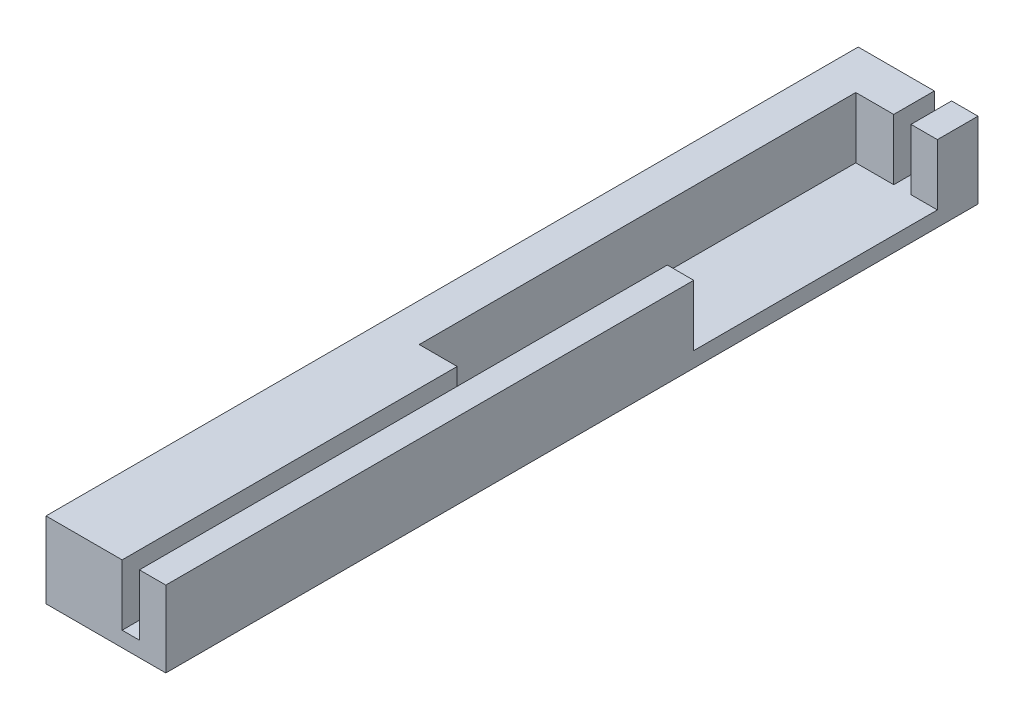
ISO-10303-21;
HEADER;
FILE_DESCRIPTION(('STEP AP214'),'2;1');
FILE_NAME('part.step','',(''),(''),'','','');
FILE_SCHEMA(('AUTOMOTIVE_DESIGN { 1 0 10303 214 1 1 1 1 }'));
ENDSEC;
DATA;
#1=APPLICATION_CONTEXT('core data for automotive mechanical design processes');
#2=APPLICATION_PROTOCOL_DEFINITION('international standard','automotive_design',2000,#1);
#3=PRODUCT_CONTEXT('',#1,'mechanical');
#4=PRODUCT('Part','Part','',(#3));
#5=PRODUCT_RELATED_PRODUCT_CATEGORY('part','',(#4));
#6=PRODUCT_DEFINITION_FORMATION('','',#4);
#7=PRODUCT_DEFINITION_CONTEXT('part definition',#1,'design');
#8=PRODUCT_DEFINITION('design','',#6,#7);
#9=PRODUCT_DEFINITION_SHAPE('','',#8);
#10=(LENGTH_UNIT() NAMED_UNIT(*) SI_UNIT(.MILLI.,.METRE.));
#11=(NAMED_UNIT(*) PLANE_ANGLE_UNIT() SI_UNIT($,.RADIAN.));
#12=(NAMED_UNIT(*) SI_UNIT($,.STERADIAN.) SOLID_ANGLE_UNIT());
#13=UNCERTAINTY_MEASURE_WITH_UNIT(LENGTH_MEASURE(1.E-05),#10,'distance_accuracy_value','');
#14=(GEOMETRIC_REPRESENTATION_CONTEXT(3) GLOBAL_UNCERTAINTY_ASSIGNED_CONTEXT((#13)) GLOBAL_UNIT_ASSIGNED_CONTEXT((#10,
#11,#12)) REPRESENTATION_CONTEXT('',''));
#15=CARTESIAN_POINT('',(0.,0.,0.));
#16=DIRECTION('',(0.,0.,1.));
#17=DIRECTION('',(1.,0.,0.));
#18=AXIS2_PLACEMENT_3D('',#15,#16,#17);
#19=CARTESIAN_POINT('',(3.73803486529319,7.5,-1.98621236133122));
#20=DIRECTION('',(-1.,0.,0.));
#21=DIRECTION('',(0.,0.,1.));
#22=AXIS2_PLACEMENT_3D('',#19,#20,#21);
#23=PLANE('',#22);
#24=DIRECTION('',(0.,0.,-1.));
#25=VECTOR('',#24,1.);
#26=CARTESIAN_POINT('',(3.73803486529319,1.5,-1.98621236133122));
#27=LINE('',#26,#25);
#28=CARTESIAN_POINT('',(3.73803486529319,1.5,78.0137876386688));
#29=VERTEX_POINT('',#28);
#30=CARTESIAN_POINT('',(3.73803486529321,1.5,45.0137876386688));
#31=VERTEX_POINT('',#30);
#32=EDGE_CURVE('E257',#29,#31,#27,.T.);
#33=ORIENTED_EDGE('',*,*,#32,.T.);
#34=DIRECTION('',(0.,1.,0.));
#35=VECTOR('',#34,1.);
#36=CARTESIAN_POINT('',(3.73803486529321,-41.662169832553,45.0137876386688));
#37=LINE('',#36,#35);
#38=CARTESIAN_POINT('',(3.73803486529321,7.5,45.0137876386688));
#39=VERTEX_POINT('',#38);
#40=EDGE_CURVE('E181',#31,#39,#37,.T.);
#41=ORIENTED_EDGE('',*,*,#40,.T.);
#42=DIRECTION('',(0.,0.,-1.));
#43=VECTOR('',#42,1.);
#44=CARTESIAN_POINT('',(3.73803486529319,7.5,-1.98621236133122));
#45=LINE('',#44,#43);
#46=CARTESIAN_POINT('',(3.73803486529319,7.5,78.0137876386688));
#47=VERTEX_POINT('',#46);
#48=EDGE_CURVE('E261',#47,#39,#45,.T.);
#49=ORIENTED_EDGE('',*,*,#48,.F.);
#50=DIRECTION('',(0.,-1.,0.));
#51=VECTOR('',#50,1.);
#52=CARTESIAN_POINT('',(3.73803486529319,7.5,78.0137876386688));
#53=LINE('',#52,#51);
#54=EDGE_CURVE('E275',#47,#29,#53,.T.);
#55=ORIENTED_EDGE('',*,*,#54,.T.);
#56=EDGE_LOOP('',(#33,#41,#49,#55));
#57=FACE_BOUND('',#56,.T.);
#58=ADVANCED_FACE('F38',(#57),#23,.F.);
#59=CARTESIAN_POINT('',(5.43803486529318,7.5,-1.98621236133122));
#60=DIRECTION('',(1.,0.,0.));
#61=DIRECTION('',(0.,0.,-1.));
#62=AXIS2_PLACEMENT_3D('',#59,#60,#61);
#63=PLANE('',#62);
#64=DIRECTION('',(0.,0.,1.));
#65=VECTOR('',#64,1.);
#66=CARTESIAN_POINT('',(5.43803486529318,1.5,-1.98621236133122));
#67=LINE('',#66,#65);
#68=CARTESIAN_POINT('',(5.43803486529318,1.5,-1.98621236133122));
#69=VERTEX_POINT('',#68);
#70=CARTESIAN_POINT('',(5.43803486529318,1.5,2.01378763866878));
#71=VERTEX_POINT('',#70);
#72=EDGE_CURVE('E240',#69,#71,#67,.T.);
#73=ORIENTED_EDGE('',*,*,#72,.T.);
#74=DIRECTION('',(0.,1.,0.));
#75=VECTOR('',#74,1.);
#76=CARTESIAN_POINT('',(5.43803486529318,-41.662169832553,2.01378763866878));
#77=LINE('',#76,#75);
#78=CARTESIAN_POINT('',(5.43803486529318,7.5,2.01378763866878));
#79=VERTEX_POINT('',#78);
#80=EDGE_CURVE('E199',#71,#79,#77,.T.);
#81=ORIENTED_EDGE('',*,*,#80,.T.);
#82=DIRECTION('',(0.,0.,1.));
#83=VECTOR('',#82,1.);
#84=CARTESIAN_POINT('',(5.43803486529318,7.5,-1.98621236133122));
#85=LINE('',#84,#83);
#86=CARTESIAN_POINT('',(5.43803486529318,7.5,-1.98621236133122));
#87=VERTEX_POINT('',#86);
#88=EDGE_CURVE('E222',#87,#79,#85,.T.);
#89=ORIENTED_EDGE('',*,*,#88,.F.);
#90=DIRECTION('',(0.,-1.,0.));
#91=VECTOR('',#90,1.);
#92=CARTESIAN_POINT('',(5.43803486529318,7.5,-1.98621236133122));
#93=LINE('',#92,#91);
#94=EDGE_CURVE('E239',#87,#69,#93,.T.);
#95=ORIENTED_EDGE('',*,*,#94,.T.);
#96=EDGE_LOOP('',(#73,#81,#89,#95));
#97=FACE_BOUND('',#96,.T.);
#98=ADVANCED_FACE('F342',(#97),#63,.F.);
#99=CARTESIAN_POINT('',(0.,7.5,0.));
#100=DIRECTION('',(0.,1.,0.));
#101=DIRECTION('',(0.,0.,1.));
#102=AXIS2_PLACEMENT_3D('',#99,#100,#101);
#103=PLANE('',#102);
#104=DIRECTION('',(-1.,0.,0.));
#105=VECTOR('',#104,1.);
#106=CARTESIAN_POINT('',(5.43803486529318,7.5,2.01378763866878));
#107=LINE('',#106,#105);
#108=CARTESIAN_POINT('',(8.0380348652932,7.5,2.01378763866878));
#109=VERTEX_POINT('',#108);
#110=EDGE_CURVE('E205',#109,#79,#107,.T.);
#111=ORIENTED_EDGE('',*,*,#110,.F.);
#112=DIRECTION('',(0.,0.,-1.));
#113=VECTOR('',#112,1.);
#114=CARTESIAN_POINT('',(8.0380348652932,7.5,-1.98621236133122));
#115=LINE('',#114,#113);
#116=CARTESIAN_POINT('',(8.0380348652932,7.5,-1.98621236133122));
#117=VERTEX_POINT('',#116);
#118=EDGE_CURVE('E231',#109,#117,#115,.T.);
#119=ORIENTED_EDGE('',*,*,#118,.T.);
#120=DIRECTION('',(-1.,0.,0.));
#121=VECTOR('',#120,1.);
#122=CARTESIAN_POINT('',(5.43803486529318,7.5,-1.98621236133122));
#123=LINE('',#122,#121);
#124=EDGE_CURVE('E236',#117,#87,#123,.T.);
#125=ORIENTED_EDGE('',*,*,#124,.T.);
#126=ORIENTED_EDGE('',*,*,#88,.T.);
#127=EDGE_LOOP('',(#111,#119,#125,#126));
#128=FACE_BOUND('',#127,.T.);
#129=ADVANCED_FACE('F345',(#128),#103,.T.);
#130=CARTESIAN_POINT('',(0.,1.5,0.));
#131=DIRECTION('',(0.,1.,0.));
#132=DIRECTION('',(0.,0.,1.));
#133=AXIS2_PLACEMENT_3D('',#130,#131,#132);
#134=PLANE('',#133);
#135=DIRECTION('',(1.,0.,0.));
#136=VECTOR('',#135,1.);
#137=CARTESIAN_POINT('',(-3.76196513470681,1.5,78.0137876386688));
#138=LINE('',#137,#136);
#139=CARTESIAN_POINT('',(5.43803486529319,1.5,78.0137876386688));
#140=VERTEX_POINT('',#139);
#141=EDGE_CURVE('E280',#29,#140,#138,.T.);
#142=ORIENTED_EDGE('',*,*,#141,.T.);
#143=CARTESIAN_POINT('',(5.43803486529319,1.5,26.0137876386688));
#144=VERTEX_POINT('',#143);
#145=EDGE_CURVE('E192',#144,#140,#67,.T.);
#146=ORIENTED_EDGE('',*,*,#145,.F.);
#147=DIRECTION('',(-1.,0.,0.));
#148=VECTOR('',#147,1.);
#149=CARTESIAN_POINT('',(5.43803486529319,1.5,26.0137876386688));
#150=LINE('',#149,#148);
#151=CARTESIAN_POINT('',(8.0380348652932,1.49999999999999,26.0137876386688));
#152=VERTEX_POINT('',#151);
#153=EDGE_CURVE('E170',#152,#144,#150,.T.);
#154=ORIENTED_EDGE('',*,*,#153,.F.);
#155=DIRECTION('',(0.,0.,1.));
#156=VECTOR('',#155,1.);
#157=CARTESIAN_POINT('',(8.0380348652932,1.5,2.01378763866878));
#158=LINE('',#157,#156);
#159=CARTESIAN_POINT('',(8.0380348652932,1.5,2.01378763866878));
#160=VERTEX_POINT('',#159);
#161=EDGE_CURVE('E194',#160,#152,#158,.T.);
#162=ORIENTED_EDGE('',*,*,#161,.F.);
#163=DIRECTION('',(1.,0.,0.));
#164=VECTOR('',#163,1.);
#165=CARTESIAN_POINT('',(5.43803486529318,1.5,2.01378763866878));
#166=LINE('',#165,#164);
#167=EDGE_CURVE('E198',#71,#160,#166,.T.);
#168=ORIENTED_EDGE('',*,*,#167,.F.);
#169=ORIENTED_EDGE('',*,*,#72,.F.);
#170=DIRECTION('',(-1.,0.,0.));
#171=VECTOR('',#170,1.);
#172=CARTESIAN_POINT('',(-3.76196513470681,1.5,-1.98621236133122));
#173=LINE('',#172,#171);
#174=CARTESIAN_POINT('',(3.73803486529319,1.5,-1.98621236133122));
#175=VERTEX_POINT('',#174);
#176=EDGE_CURVE('E284',#69,#175,#173,.T.);
#177=ORIENTED_EDGE('',*,*,#176,.T.);
#178=CARTESIAN_POINT('',(3.73803486529319,1.5,2.01378763866877));
#179=VERTEX_POINT('',#178);
#180=EDGE_CURVE('E251',#179,#175,#27,.T.);
#181=ORIENTED_EDGE('',*,*,#180,.F.);
#182=DIRECTION('',(1.,0.,0.));
#183=VECTOR('',#182,1.);
#184=CARTESIAN_POINT('',(3.73803486529319,1.5,2.01378763866877));
#185=LINE('',#184,#183);
#186=CARTESIAN_POINT('',(0.,1.49999999999999,2.01378763866878));
#187=VERTEX_POINT('',#186);
#188=EDGE_CURVE('E189',#187,#179,#185,.T.);
#189=ORIENTED_EDGE('',*,*,#188,.F.);
#190=DIRECTION('',(0.,0.,-1.));
#191=VECTOR('',#190,1.);
#192=CARTESIAN_POINT('',(0.,1.5,2.01378763866878));
#193=LINE('',#192,#191);
#194=CARTESIAN_POINT('',(0.,1.5,45.0137876386688));
#195=VERTEX_POINT('',#194);
#196=EDGE_CURVE('E160',#195,#187,#193,.T.);
#197=ORIENTED_EDGE('',*,*,#196,.F.);
#198=DIRECTION('',(-1.,0.,0.));
#199=VECTOR('',#198,1.);
#200=CARTESIAN_POINT('',(3.73803486529321,1.5,45.0137876386688));
#201=LINE('',#200,#199);
#202=EDGE_CURVE('E193',#31,#195,#201,.T.);
#203=ORIENTED_EDGE('',*,*,#202,.F.);
#204=ORIENTED_EDGE('',*,*,#32,.F.);
#205=EDGE_LOOP('',(#142,#146,#154,#162,#168,#169,#177,#181,#189,#197,#203,#204));
#206=FACE_BOUND('',#205,.T.);
#207=ADVANCED_FACE('F337',(#206),#134,.T.);
#208=CARTESIAN_POINT('',(-3.76196513470681,1.5,-1.98621236133122));
#209=DIRECTION('',(1.,0.,0.));
#210=DIRECTION('',(0.,0.,-1.));
#211=AXIS2_PLACEMENT_3D('',#208,#209,#210);
#212=PLANE('',#211);
#213=DIRECTION('',(0.,0.,1.));
#214=VECTOR('',#213,1.);
#215=CARTESIAN_POINT('',(-3.76196513470681,0.,-1.98621236133122));
#216=LINE('',#215,#214);
#217=CARTESIAN_POINT('',(-3.76196513470681,0.,-1.98621236133122));
#218=VERTEX_POINT('',#217);
#219=CARTESIAN_POINT('',(-3.76196513470681,0.,78.0137876386688));
#220=VERTEX_POINT('',#219);
#221=EDGE_CURVE('E279',#218,#220,#216,.T.);
#222=ORIENTED_EDGE('',*,*,#221,.T.);
#223=DIRECTION('',(0.,-1.,0.));
#224=VECTOR('',#223,1.);
#225=CARTESIAN_POINT('',(-3.76196513470681,1.5,78.0137876386688));
#226=LINE('',#225,#224);
#227=CARTESIAN_POINT('',(-3.76196513470681,7.5,78.0137876386688));
#228=VERTEX_POINT('',#227);
#229=EDGE_CURVE('E11',#228,#220,#226,.T.);
#230=ORIENTED_EDGE('',*,*,#229,.F.);
#231=DIRECTION('',(0.,0.,1.));
#232=VECTOR('',#231,1.);
#233=CARTESIAN_POINT('',(-3.76196513470681,7.5,-1.98621236133122));
#234=LINE('',#233,#232);
#235=CARTESIAN_POINT('',(-3.76196513470681,7.5,-1.98621236133122));
#236=VERTEX_POINT('',#235);
#237=EDGE_CURVE('E252',#236,#228,#234,.T.);
#238=ORIENTED_EDGE('',*,*,#237,.F.);
#239=DIRECTION('',(0.,-1.,0.));
#240=VECTOR('',#239,1.);
#241=CARTESIAN_POINT('',(-3.76196513470681,1.5,-1.98621236133122));
#242=LINE('',#241,#240);
#243=EDGE_CURVE('E289',#236,#218,#242,.T.);
#244=ORIENTED_EDGE('',*,*,#243,.T.);
#245=EDGE_LOOP('',(#222,#230,#238,#244));
#246=FACE_BOUND('',#245,.T.);
#247=ADVANCED_FACE('F40',(#246),#212,.F.);
#248=CARTESIAN_POINT('',(-3.76196513470681,1.5,78.0137876386688));
#249=DIRECTION('',(0.,0.,-1.));
#250=DIRECTION('',(-1.,0.,0.));
#251=AXIS2_PLACEMENT_3D('',#248,#249,#250);
#252=PLANE('',#251);
#253=DIRECTION('',(1.,0.,0.));
#254=VECTOR('',#253,1.);
#255=CARTESIAN_POINT('',(-3.76196513470681,0.,78.0137876386688));
#256=LINE('',#255,#254);
#257=CARTESIAN_POINT('',(8.0380348652932,0.,78.0137876386688));
#258=VERTEX_POINT('',#257);
#259=EDGE_CURVE('E293',#220,#258,#256,.T.);
#260=ORIENTED_EDGE('',*,*,#259,.T.);
#261=DIRECTION('',(0.,-1.,0.));
#262=VECTOR('',#261,1.);
#263=CARTESIAN_POINT('',(8.0380348652932,1.5,78.0137876386688));
#264=LINE('',#263,#262);
#265=CARTESIAN_POINT('',(8.0380348652932,7.5,78.0137876386688));
#266=VERTEX_POINT('',#265);
#267=EDGE_CURVE('E47',#266,#258,#264,.T.);
#268=ORIENTED_EDGE('',*,*,#267,.F.);
#269=DIRECTION('',(1.,0.,0.));
#270=VECTOR('',#269,1.);
#271=CARTESIAN_POINT('',(5.43803486529319,7.5,78.0137876386688));
#272=LINE('',#271,#270);
#273=CARTESIAN_POINT('',(5.43803486529319,7.5,78.0137876386688));
#274=VERTEX_POINT('',#273);
#275=EDGE_CURVE('E226',#274,#266,#272,.T.);
#276=ORIENTED_EDGE('',*,*,#275,.F.);
#277=DIRECTION('',(0.,-1.,0.));
#278=VECTOR('',#277,1.);
#279=CARTESIAN_POINT('',(5.43803486529319,7.5,78.0137876386688));
#280=LINE('',#279,#278);
#281=EDGE_CURVE('E247',#274,#140,#280,.T.);
#282=ORIENTED_EDGE('',*,*,#281,.T.);
#283=ORIENTED_EDGE('',*,*,#141,.F.);
#284=ORIENTED_EDGE('',*,*,#54,.F.);
#285=DIRECTION('',(1.,0.,0.));
#286=VECTOR('',#285,1.);
#287=CARTESIAN_POINT('',(-3.76196513470681,7.5,78.0137876386688));
#288=LINE('',#287,#286);
#289=EDGE_CURVE('E256',#228,#47,#288,.T.);
#290=ORIENTED_EDGE('',*,*,#289,.F.);
#291=ORIENTED_EDGE('',*,*,#229,.T.);
#292=EDGE_LOOP('',(#260,#268,#276,#282,#283,#284,#290,#291));
#293=FACE_BOUND('',#292,.T.);
#294=ADVANCED_FACE('F359',(#293),#252,.F.);
#295=CARTESIAN_POINT('',(8.03803486529319,1.5,-1.98621236133122));
#296=DIRECTION('',(-1.,0.,0.));
#297=DIRECTION('',(0.,0.,1.));
#298=AXIS2_PLACEMENT_3D('',#295,#296,#297);
#299=PLANE('',#298);
#300=ORIENTED_EDGE('',*,*,#118,.F.);
#301=DIRECTION('',(0.,1.,0.));
#302=VECTOR('',#301,1.);
#303=CARTESIAN_POINT('',(8.0380348652932,-41.662169832553,2.01378763866878));
#304=LINE('',#303,#302);
#305=EDGE_CURVE('E211',#160,#109,#304,.T.);
#306=ORIENTED_EDGE('',*,*,#305,.F.);
#307=ORIENTED_EDGE('',*,*,#161,.T.);
#308=DIRECTION('',(0.,1.,0.));
#309=VECTOR('',#308,1.);
#310=CARTESIAN_POINT('',(8.0380348652932,-41.662169832553,26.0137876386688));
#311=LINE('',#310,#309);
#312=CARTESIAN_POINT('',(8.0380348652932,7.5,26.0137876386688));
#313=VERTEX_POINT('',#312);
#314=EDGE_CURVE('E214',#152,#313,#311,.T.);
#315=ORIENTED_EDGE('',*,*,#314,.T.);
#316=EDGE_CURVE('E232',#266,#313,#115,.T.);
#317=ORIENTED_EDGE('',*,*,#316,.F.);
#318=ORIENTED_EDGE('',*,*,#267,.T.);
#319=DIRECTION('',(0.,0.,-1.));
#320=VECTOR('',#319,1.);
#321=CARTESIAN_POINT('',(8.03803486529319,0.,-1.98621236133122));
#322=LINE('',#321,#320);
#323=CARTESIAN_POINT('',(8.03803486529319,0.,-1.98621236133122));
#324=VERTEX_POINT('',#323);
#325=EDGE_CURVE('E296',#258,#324,#322,.T.);
#326=ORIENTED_EDGE('',*,*,#325,.T.);
#327=DIRECTION('',(0.,-1.,0.));
#328=VECTOR('',#327,1.);
#329=CARTESIAN_POINT('',(8.03803486529319,1.5,-1.98621236133122));
#330=LINE('',#329,#328);
#331=EDGE_CURVE('E304',#117,#324,#330,.T.);
#332=ORIENTED_EDGE('',*,*,#331,.F.);
#333=EDGE_LOOP('',(#300,#306,#307,#315,#317,#318,#326,#332));
#334=FACE_BOUND('',#333,.T.);
#335=ADVANCED_FACE('F313',(#334),#299,.F.);
#336=CARTESIAN_POINT('',(-3.76196513470681,1.5,-1.98621236133122));
#337=DIRECTION('',(0.,0.,1.));
#338=DIRECTION('',(1.,0.,0.));
#339=AXIS2_PLACEMENT_3D('',#336,#337,#338);
#340=PLANE('',#339);
#341=DIRECTION('',(-1.,0.,0.));
#342=VECTOR('',#341,1.);
#343=CARTESIAN_POINT('',(-3.76196513470681,0.,-1.98621236133122));
#344=LINE('',#343,#342);
#345=EDGE_CURVE('E285',#324,#218,#344,.T.);
#346=ORIENTED_EDGE('',*,*,#345,.T.);
#347=ORIENTED_EDGE('',*,*,#243,.F.);
#348=DIRECTION('',(-1.,0.,0.));
#349=VECTOR('',#348,1.);
#350=CARTESIAN_POINT('',(-3.76196513470681,7.5,-1.98621236133122));
#351=LINE('',#350,#349);
#352=CARTESIAN_POINT('',(3.73803486529319,7.5,-1.98621236133122));
#353=VERTEX_POINT('',#352);
#354=EDGE_CURVE('E264',#353,#236,#351,.T.);
#355=ORIENTED_EDGE('',*,*,#354,.F.);
#356=DIRECTION('',(0.,-1.,0.));
#357=VECTOR('',#356,1.);
#358=CARTESIAN_POINT('',(3.73803486529319,7.5,-1.98621236133122));
#359=LINE('',#358,#357);
#360=EDGE_CURVE('E268',#353,#175,#359,.T.);
#361=ORIENTED_EDGE('',*,*,#360,.T.);
#362=ORIENTED_EDGE('',*,*,#176,.F.);
#363=ORIENTED_EDGE('',*,*,#94,.F.);
#364=ORIENTED_EDGE('',*,*,#124,.F.);
#365=ORIENTED_EDGE('',*,*,#331,.T.);
#366=EDGE_LOOP('',(#346,#347,#355,#361,#362,#363,#364,#365));
#367=FACE_BOUND('',#366,.T.);
#368=ADVANCED_FACE('F322',(#367),#340,.F.);
#369=CARTESIAN_POINT('',(0.,0.,0.));
#370=DIRECTION('',(0.,1.,0.));
#371=DIRECTION('',(0.,0.,1.));
#372=AXIS2_PLACEMENT_3D('',#369,#370,#371);
#373=PLANE('',#372);
#374=ORIENTED_EDGE('',*,*,#221,.F.);
#375=ORIENTED_EDGE('',*,*,#345,.F.);
#376=ORIENTED_EDGE('',*,*,#325,.F.);
#377=ORIENTED_EDGE('',*,*,#259,.F.);
#378=EDGE_LOOP('',(#374,#375,#376,#377));
#379=FACE_BOUND('',#378,.T.);
#380=ADVANCED_FACE('F320',(#379),#373,.F.);
#381=CARTESIAN_POINT('',(3.73803486529319,7.5,2.01378763866878));
#382=VERTEX_POINT('',#381);
#383=EDGE_CURVE('E260',#382,#353,#45,.T.);
#384=ORIENTED_EDGE('',*,*,#383,.F.);
#385=DIRECTION('',(0.,1.,0.));
#386=VECTOR('',#385,1.);
#387=CARTESIAN_POINT('',(3.73803486529319,-41.662169832553,2.01378763866877));
#388=LINE('',#387,#386);
#389=EDGE_CURVE('E54',#179,#382,#388,.T.);
#390=ORIENTED_EDGE('',*,*,#389,.F.);
#391=ORIENTED_EDGE('',*,*,#180,.T.);
#392=ORIENTED_EDGE('',*,*,#360,.F.);
#393=EDGE_LOOP('',(#384,#390,#391,#392));
#394=FACE_BOUND('',#393,.T.);
#395=ADVANCED_FACE('F333',(#394),#23,.F.);
#396=CARTESIAN_POINT('',(0.,7.5,0.));
#397=DIRECTION('',(0.,1.,0.));
#398=DIRECTION('',(0.,0.,1.));
#399=AXIS2_PLACEMENT_3D('',#396,#397,#398);
#400=PLANE('',#399);
#401=DIRECTION('',(1.,0.,0.));
#402=VECTOR('',#401,1.);
#403=CARTESIAN_POINT('',(3.73803486529321,7.5,45.0137876386688));
#404=LINE('',#403,#402);
#405=CARTESIAN_POINT('',(0.,7.5,45.0137876386688));
#406=VERTEX_POINT('',#405);
#407=EDGE_CURVE('E174',#406,#39,#404,.T.);
#408=ORIENTED_EDGE('',*,*,#407,.F.);
#409=DIRECTION('',(0.,0.,1.));
#410=VECTOR('',#409,1.);
#411=CARTESIAN_POINT('',(0.,7.5,2.01378763866878));
#412=LINE('',#411,#410);
#413=CARTESIAN_POINT('',(0.,7.5,2.01378763866878));
#414=VERTEX_POINT('',#413);
#415=EDGE_CURVE('E157',#414,#406,#412,.T.);
#416=ORIENTED_EDGE('',*,*,#415,.F.);
#417=DIRECTION('',(-1.,0.,0.));
#418=VECTOR('',#417,1.);
#419=CARTESIAN_POINT('',(3.73803486529319,7.5,2.01378763866877));
#420=LINE('',#419,#418);
#421=EDGE_CURVE('E165',#382,#414,#420,.T.);
#422=ORIENTED_EDGE('',*,*,#421,.F.);
#423=ORIENTED_EDGE('',*,*,#383,.T.);
#424=ORIENTED_EDGE('',*,*,#354,.T.);
#425=ORIENTED_EDGE('',*,*,#237,.T.);
#426=ORIENTED_EDGE('',*,*,#289,.T.);
#427=ORIENTED_EDGE('',*,*,#48,.T.);
#428=EDGE_LOOP('',(#408,#416,#422,#423,#424,#425,#426,#427));
#429=FACE_BOUND('',#428,.T.);
#430=ADVANCED_FACE('F172',(#429),#400,.T.);
#431=CARTESIAN_POINT('',(5.43803486529319,7.5,26.0137876386688));
#432=VERTEX_POINT('',#431);
#433=EDGE_CURVE('E227',#432,#274,#85,.T.);
#434=ORIENTED_EDGE('',*,*,#433,.F.);
#435=DIRECTION('',(0.,1.,0.));
#436=VECTOR('',#435,1.);
#437=CARTESIAN_POINT('',(5.43803486529319,-41.662169832553,26.0137876386688));
#438=LINE('',#437,#436);
#439=EDGE_CURVE('E62',#144,#432,#438,.T.);
#440=ORIENTED_EDGE('',*,*,#439,.F.);
#441=ORIENTED_EDGE('',*,*,#145,.T.);
#442=ORIENTED_EDGE('',*,*,#281,.F.);
#443=EDGE_LOOP('',(#434,#440,#441,#442));
#444=FACE_BOUND('',#443,.T.);
#445=ADVANCED_FACE('F369',(#444),#63,.F.);
#446=DIRECTION('',(1.,0.,0.));
#447=VECTOR('',#446,1.);
#448=CARTESIAN_POINT('',(5.43803486529319,7.5,26.0137876386688));
#449=LINE('',#448,#447);
#450=EDGE_CURVE('E202',#432,#313,#449,.T.);
#451=ORIENTED_EDGE('',*,*,#450,.F.);
#452=ORIENTED_EDGE('',*,*,#433,.T.);
#453=ORIENTED_EDGE('',*,*,#275,.T.);
#454=ORIENTED_EDGE('',*,*,#316,.T.);
#455=EDGE_LOOP('',(#451,#452,#453,#454));
#456=FACE_BOUND('',#455,.T.);
#457=ADVANCED_FACE('F398',(#456),#103,.T.);
#458=CARTESIAN_POINT('',(5.43803486529318,-41.662169832553,2.01378763866878));
#459=DIRECTION('',(0.,0.,-1.));
#460=DIRECTION('',(-1.,0.,0.));
#461=AXIS2_PLACEMENT_3D('',#458,#459,#460);
#462=PLANE('',#461);
#463=ORIENTED_EDGE('',*,*,#167,.T.);
#464=ORIENTED_EDGE('',*,*,#305,.T.);
#465=ORIENTED_EDGE('',*,*,#110,.T.);
#466=ORIENTED_EDGE('',*,*,#80,.F.);
#467=EDGE_LOOP('',(#463,#464,#465,#466));
#468=FACE_BOUND('',#467,.T.);
#469=ADVANCED_FACE('F403',(#468),#462,.F.);
#470=CARTESIAN_POINT('',(5.43803486529319,-41.662169832553,26.0137876386688));
#471=DIRECTION('',(0.,0.,1.));
#472=DIRECTION('',(1.,0.,0.));
#473=AXIS2_PLACEMENT_3D('',#470,#471,#472);
#474=PLANE('',#473);
#475=ORIENTED_EDGE('',*,*,#153,.T.);
#476=ORIENTED_EDGE('',*,*,#439,.T.);
#477=ORIENTED_EDGE('',*,*,#450,.T.);
#478=ORIENTED_EDGE('',*,*,#314,.F.);
#479=EDGE_LOOP('',(#475,#476,#477,#478));
#480=FACE_BOUND('',#479,.T.);
#481=ADVANCED_FACE('F409',(#480),#474,.F.);
#482=CARTESIAN_POINT('',(3.73803486529321,-41.662169832553,45.0137876386688));
#483=DIRECTION('',(0.,0.,1.));
#484=DIRECTION('',(1.,0.,0.));
#485=AXIS2_PLACEMENT_3D('',#482,#483,#484);
#486=PLANE('',#485);
#487=ORIENTED_EDGE('',*,*,#202,.T.);
#488=DIRECTION('',(0.,1.,0.));
#489=VECTOR('',#488,1.);
#490=CARTESIAN_POINT('',(0.,-41.662169832553,45.0137876386688));
#491=LINE('',#490,#489);
#492=EDGE_CURVE('E163',#195,#406,#491,.T.);
#493=ORIENTED_EDGE('',*,*,#492,.T.);
#494=ORIENTED_EDGE('',*,*,#407,.T.);
#495=ORIENTED_EDGE('',*,*,#40,.F.);
#496=EDGE_LOOP('',(#487,#493,#494,#495));
#497=FACE_BOUND('',#496,.T.);
#498=ADVANCED_FACE('F355',(#497),#486,.F.);
#499=CARTESIAN_POINT('',(0.,-41.662169832553,2.01378763866878));
#500=DIRECTION('',(-1.,0.,0.));
#501=DIRECTION('',(0.,0.,1.));
#502=AXIS2_PLACEMENT_3D('',#499,#500,#501);
#503=PLANE('',#502);
#504=ORIENTED_EDGE('',*,*,#196,.T.);
#505=DIRECTION('',(0.,1.,0.));
#506=VECTOR('',#505,1.);
#507=CARTESIAN_POINT('',(0.,-41.662169832553,2.01378763866878));
#508=LINE('',#507,#506);
#509=EDGE_CURVE('E153',#187,#414,#508,.T.);
#510=ORIENTED_EDGE('',*,*,#509,.T.);
#511=ORIENTED_EDGE('',*,*,#415,.T.);
#512=ORIENTED_EDGE('',*,*,#492,.F.);
#513=EDGE_LOOP('',(#504,#510,#511,#512));
#514=FACE_BOUND('',#513,.T.);
#515=ADVANCED_FACE('F154',(#514),#503,.F.);
#516=CARTESIAN_POINT('',(3.73803486529319,-41.662169832553,2.01378763866877));
#517=DIRECTION('',(0.,0.,-1.));
#518=DIRECTION('',(-1.,0.,0.));
#519=AXIS2_PLACEMENT_3D('',#516,#517,#518);
#520=PLANE('',#519);
#521=ORIENTED_EDGE('',*,*,#188,.T.);
#522=ORIENTED_EDGE('',*,*,#389,.T.);
#523=ORIENTED_EDGE('',*,*,#421,.T.);
#524=ORIENTED_EDGE('',*,*,#509,.F.);
#525=EDGE_LOOP('',(#521,#522,#523,#524));
#526=FACE_BOUND('',#525,.T.);
#527=ADVANCED_FACE('F166',(#526),#520,.F.);
#528=CLOSED_SHELL('',(#58,#98,#129,#207,#247,#294,#335,#368,#380,#395,#430,#445,#457,#469,#481,
#498,#515,#527));
#529=MANIFOLD_SOLID_BREP('B2',#528);
#530=ADVANCED_BREP_SHAPE_REPRESENTATION('',(#18,#529),#14);
#531=SHAPE_DEFINITION_REPRESENTATION(#9,#530);
ENDSEC;
END-ISO-10303-21;
